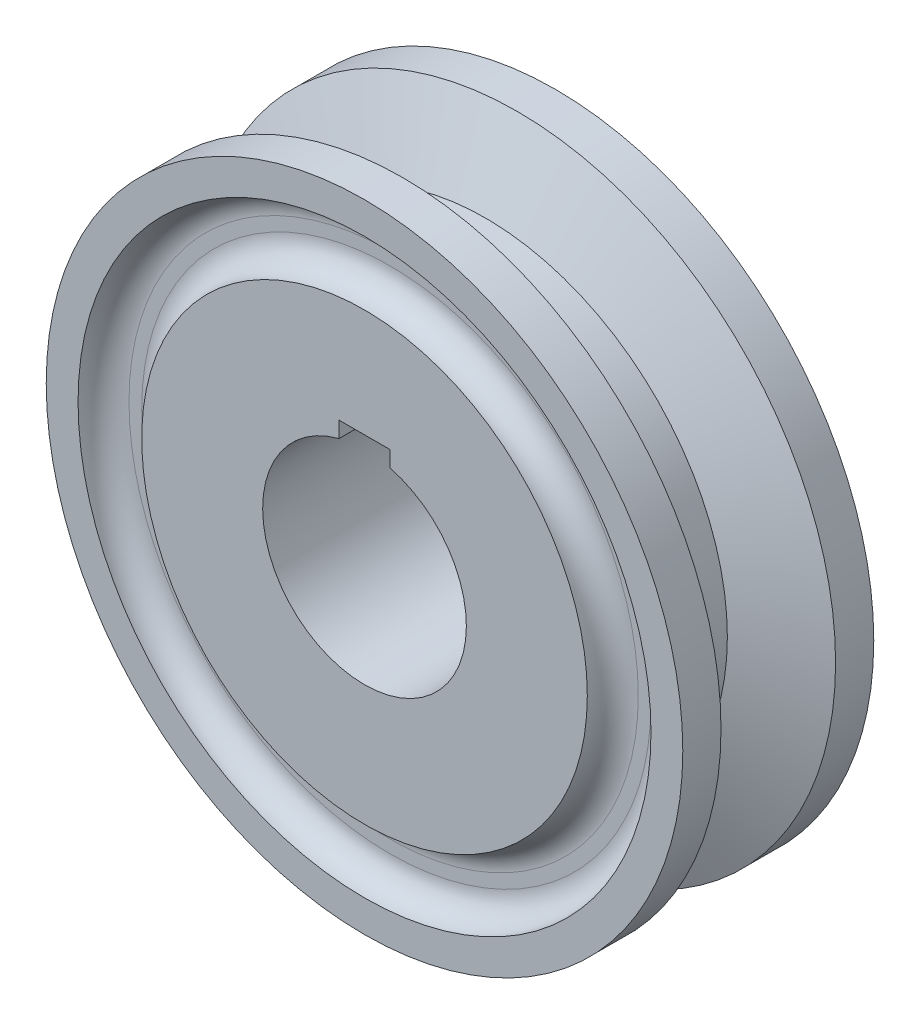
ISO-10303-21;
HEADER;
FILE_DESCRIPTION(('STEP AP214'),'2;1');
FILE_NAME('part.step','',(''),(''),'','','');
FILE_SCHEMA(('AUTOMOTIVE_DESIGN { 1 0 10303 214 1 1 1 1 }'));
ENDSEC;
DATA;
#1=APPLICATION_CONTEXT('core data for automotive mechanical design processes');
#2=APPLICATION_PROTOCOL_DEFINITION('international standard','automotive_design',2000,#1);
#3=PRODUCT_CONTEXT('',#1,'mechanical');
#4=PRODUCT('Part','Part','',(#3));
#5=PRODUCT_RELATED_PRODUCT_CATEGORY('part','',(#4));
#6=PRODUCT_DEFINITION_FORMATION('','',#4);
#7=PRODUCT_DEFINITION_CONTEXT('part definition',#1,'design');
#8=PRODUCT_DEFINITION('design','',#6,#7);
#9=PRODUCT_DEFINITION_SHAPE('','',#8);
#10=(LENGTH_UNIT() NAMED_UNIT(*) SI_UNIT(.MILLI.,.METRE.));
#11=(NAMED_UNIT(*) PLANE_ANGLE_UNIT() SI_UNIT($,.RADIAN.));
#12=(NAMED_UNIT(*) SI_UNIT($,.STERADIAN.) SOLID_ANGLE_UNIT());
#13=UNCERTAINTY_MEASURE_WITH_UNIT(LENGTH_MEASURE(1.E-05),#10,'distance_accuracy_value','');
#14=(GEOMETRIC_REPRESENTATION_CONTEXT(3) GLOBAL_UNCERTAINTY_ASSIGNED_CONTEXT((#13)) GLOBAL_UNIT_ASSIGNED_CONTEXT((#10,
#11,#12)) REPRESENTATION_CONTEXT('',''));
#15=CARTESIAN_POINT('',(0.,0.,0.));
#16=DIRECTION('',(0.,0.,1.));
#17=DIRECTION('',(1.,0.,0.));
#18=AXIS2_PLACEMENT_3D('',#15,#16,#17);
#19=CARTESIAN_POINT('',(0.,25.,-7.5));
#20=DIRECTION('',(0.,0.,1.));
#21=DIRECTION('',(1.,0.,0.));
#22=AXIS2_PLACEMENT_3D('',#19,#20,#21);
#23=PLANE('',#22);
#24=DIRECTION('',(0.,-1.,0.));
#25=VECTOR('',#24,1.);
#26=CARTESIAN_POINT('',(-2.,9.,-7.50000000000001));
#27=LINE('',#26,#25);
#28=CARTESIAN_POINT('',(-2.,9.,-7.50000000000001));
#29=VERTEX_POINT('',#28);
#30=CARTESIAN_POINT('',(-2.,7.74596669241483,-7.50000000000001));
#31=VERTEX_POINT('',#30);
#32=EDGE_CURVE('E96',#29,#31,#27,.T.);
#33=ORIENTED_EDGE('',*,*,#32,.T.);
#34=CARTESIAN_POINT('',(0.,0.,-7.50000000000001));
#35=DIRECTION('',(0.,0.,1.));
#36=DIRECTION('',(1.,0.,0.));
#37=AXIS2_PLACEMENT_3D('',#34,#35,#36);
#38=CIRCLE('',#37,8.);
#39=CARTESIAN_POINT('',(2.,7.74596669241483,-7.50000000000001));
#40=VERTEX_POINT('',#39);
#41=EDGE_CURVE('E89',#31,#40,#38,.T.);
#42=ORIENTED_EDGE('',*,*,#41,.T.);
#43=DIRECTION('',(0.,1.,0.));
#44=VECTOR('',#43,1.);
#45=CARTESIAN_POINT('',(2.,9.,-7.50000000000001));
#46=LINE('',#45,#44);
#47=CARTESIAN_POINT('',(2.,9.,-7.5));
#48=VERTEX_POINT('',#47);
#49=EDGE_CURVE('E99',#40,#48,#46,.T.);
#50=ORIENTED_EDGE('',*,*,#49,.T.);
#51=DIRECTION('',(-1.,0.,0.));
#52=VECTOR('',#51,1.);
#53=CARTESIAN_POINT('',(-2.,9.,-7.50000000000001));
#54=LINE('',#53,#52);
#55=EDGE_CURVE('E69',#48,#29,#54,.T.);
#56=ORIENTED_EDGE('',*,*,#55,.T.);
#57=EDGE_LOOP('',(#33,#42,#50,#56));
#58=FACE_BOUND('',#57,.T.);
#59=CARTESIAN_POINT('',(0.,0.,-7.5));
#60=DIRECTION('',(0.,0.,-1.));
#61=DIRECTION('',(-1.,0.,0.));
#62=AXIS2_PLACEMENT_3D('',#59,#60,#61);
#63=CIRCLE('',#62,17.5);
#64=CARTESIAN_POINT('',(-17.5,0.,-7.5));
#65=VERTEX_POINT('',#64);
#66=EDGE_CURVE('E179',#65,#65,#63,.T.);
#67=ORIENTED_EDGE('',*,*,#66,.T.);
#68=EDGE_LOOP('',(#67));
#69=FACE_BOUND('',#68,.T.);
#70=ADVANCED_FACE('F45',(#58,#69),#23,.F.);
#71=CARTESIAN_POINT('',(0.,25.,7.5));
#72=DIRECTION('',(0.,0.,-1.));
#73=DIRECTION('',(-1.,0.,0.));
#74=AXIS2_PLACEMENT_3D('',#71,#72,#73);
#75=PLANE('',#74);
#76=DIRECTION('',(0.,1.,0.));
#77=VECTOR('',#76,1.);
#78=CARTESIAN_POINT('',(2.,9.,7.5));
#79=LINE('',#78,#77);
#80=CARTESIAN_POINT('',(2.,7.74596669241483,7.5));
#81=VERTEX_POINT('',#80);
#82=CARTESIAN_POINT('',(2.,9.,7.5));
#83=VERTEX_POINT('',#82);
#84=EDGE_CURVE('E123',#81,#83,#79,.T.);
#85=ORIENTED_EDGE('',*,*,#84,.F.);
#86=CARTESIAN_POINT('',(0.,0.,7.5));
#87=DIRECTION('',(0.,0.,1.));
#88=DIRECTION('',(1.,0.,0.));
#89=AXIS2_PLACEMENT_3D('',#86,#87,#88);
#90=CIRCLE('',#89,8.);
#91=CARTESIAN_POINT('',(-2.,7.74596669241483,7.5));
#92=VERTEX_POINT('',#91);
#93=EDGE_CURVE('E61',#92,#81,#90,.T.);
#94=ORIENTED_EDGE('',*,*,#93,.F.);
#95=DIRECTION('',(0.,-1.,0.));
#96=VECTOR('',#95,1.);
#97=CARTESIAN_POINT('',(-2.,9.,7.5));
#98=LINE('',#97,#96);
#99=CARTESIAN_POINT('',(-2.,9.,7.5));
#100=VERTEX_POINT('',#99);
#101=EDGE_CURVE('E107',#100,#92,#98,.T.);
#102=ORIENTED_EDGE('',*,*,#101,.F.);
#103=DIRECTION('',(-1.,0.,0.));
#104=VECTOR('',#103,1.);
#105=CARTESIAN_POINT('',(-2.,9.,7.5));
#106=LINE('',#105,#104);
#107=EDGE_CURVE('E111',#83,#100,#106,.T.);
#108=ORIENTED_EDGE('',*,*,#107,.F.);
#109=EDGE_LOOP('',(#85,#94,#102,#108));
#110=FACE_BOUND('',#109,.T.);
#111=CARTESIAN_POINT('',(0.,0.,7.5));
#112=DIRECTION('',(0.,0.,1.));
#113=DIRECTION('',(1.,0.,0.));
#114=AXIS2_PLACEMENT_3D('',#111,#112,#113);
#115=CIRCLE('',#114,17.5);
#116=CARTESIAN_POINT('',(17.5,0.,7.5));
#117=VERTEX_POINT('',#116);
#118=EDGE_CURVE('E185',#117,#117,#115,.T.);
#119=ORIENTED_EDGE('',*,*,#118,.T.);
#120=EDGE_LOOP('',(#119));
#121=FACE_BOUND('',#120,.T.);
#122=ADVANCED_FACE('F202',(#110,#121),#75,.F.);
#123=CARTESIAN_POINT('',(0.,0.,7.5));
#124=DIRECTION('',(0.,0.,1.));
#125=DIRECTION('',(1.,0.,0.));
#126=AXIS2_PLACEMENT_3D('',#123,#124,#125);
#127=CIRCLE('',#126,22.5);
#128=CARTESIAN_POINT('',(22.5,0.,7.5));
#129=VERTEX_POINT('',#128);
#130=EDGE_CURVE('E114',#129,#129,#127,.T.);
#131=ORIENTED_EDGE('',*,*,#130,.F.);
#132=EDGE_LOOP('',(#131));
#133=FACE_BOUND('',#132,.T.);
#134=CARTESIAN_POINT('',(0.,0.,7.50000000000001));
#135=DIRECTION('',(0.,0.,1.));
#136=DIRECTION('',(1.,0.,0.));
#137=AXIS2_PLACEMENT_3D('',#134,#135,#136);
#138=CIRCLE('',#137,25.);
#139=CARTESIAN_POINT('',(25.,0.,7.50000000000001));
#140=VERTEX_POINT('',#139);
#141=EDGE_CURVE('E132',#140,#140,#138,.T.);
#142=ORIENTED_EDGE('',*,*,#141,.T.);
#143=EDGE_LOOP('',(#142));
#144=FACE_BOUND('',#143,.T.);
#145=ADVANCED_FACE('F198',(#133,#144),#75,.F.);
#146=CARTESIAN_POINT('',(0.,0.,-7.5));
#147=DIRECTION('',(0.,0.,-1.));
#148=DIRECTION('',(-1.,0.,0.));
#149=AXIS2_PLACEMENT_3D('',#146,#147,#148);
#150=CIRCLE('',#149,22.5);
#151=CARTESIAN_POINT('',(-22.5,0.,-7.5));
#152=VERTEX_POINT('',#151);
#153=EDGE_CURVE('E181',#152,#152,#150,.T.);
#154=ORIENTED_EDGE('',*,*,#153,.F.);
#155=EDGE_LOOP('',(#154));
#156=FACE_BOUND('',#155,.T.);
#157=CARTESIAN_POINT('',(0.,0.,-7.50000000000001));
#158=DIRECTION('',(0.,0.,1.));
#159=DIRECTION('',(1.,0.,0.));
#160=AXIS2_PLACEMENT_3D('',#157,#158,#159);
#161=CIRCLE('',#160,25.);
#162=CARTESIAN_POINT('',(25.,0.,-7.50000000000001));
#163=VERTEX_POINT('',#162);
#164=EDGE_CURVE('E157',#163,#163,#161,.T.);
#165=ORIENTED_EDGE('',*,*,#164,.F.);
#166=EDGE_LOOP('',(#165));
#167=FACE_BOUND('',#166,.T.);
#168=ADVANCED_FACE('F201',(#156,#167),#23,.F.);
#169=CARTESIAN_POINT('',(0.,0.,350.137387164883));
#170=DIRECTION('',(0.,0.,1.));
#171=DIRECTION('',(1.,0.,0.));
#172=AXIS2_PLACEMENT_3D('',#169,#170,#171);
#173=CYLINDRICAL_SURFACE('',#172,25.);
#174=CARTESIAN_POINT('',(0.,0.,-4.5));
#175=DIRECTION('',(0.,0.,1.));
#176=DIRECTION('',(1.,0.,0.));
#177=AXIS2_PLACEMENT_3D('',#174,#175,#176);
#178=CIRCLE('',#177,25.);
#179=CARTESIAN_POINT('',(25.,0.,-4.5));
#180=VERTEX_POINT('',#179);
#181=EDGE_CURVE('E153',#180,#180,#178,.T.);
#182=ORIENTED_EDGE('',*,*,#181,.F.);
#183=EDGE_LOOP('',(#182));
#184=FACE_BOUND('',#183,.T.);
#185=ORIENTED_EDGE('',*,*,#164,.T.);
#186=EDGE_LOOP('',(#185));
#187=FACE_BOUND('',#186,.T.);
#188=ADVANCED_FACE('F227',(#184,#187),#173,.T.);
#189=CARTESIAN_POINT('',(0.,0.,-4.5));
#190=DIRECTION('',(0.,0.,-1.));
#191=DIRECTION('',(-1.,0.,0.));
#192=AXIS2_PLACEMENT_3D('',#189,#190,#191);
#193=CONICAL_SURFACE('',#192,25.,1.17600520709513);
#194=CARTESIAN_POINT('',(0.,0.,-2.));
#195=DIRECTION('',(0.,0.,1.));
#196=DIRECTION('',(1.,0.,0.));
#197=AXIS2_PLACEMENT_3D('',#194,#195,#196);
#198=CIRCLE('',#197,19.);
#199=CARTESIAN_POINT('',(19.,0.,-2.));
#200=VERTEX_POINT('',#199);
#201=EDGE_CURVE('E149',#200,#200,#198,.T.);
#202=ORIENTED_EDGE('',*,*,#201,.F.);
#203=EDGE_LOOP('',(#202));
#204=FACE_BOUND('',#203,.T.);
#205=ORIENTED_EDGE('',*,*,#181,.T.);
#206=EDGE_LOOP('',(#205));
#207=FACE_BOUND('',#206,.T.);
#208=ADVANCED_FACE('F221',(#204,#207),#193,.T.);
#209=CARTESIAN_POINT('',(0.,0.,350.137387164883));
#210=DIRECTION('',(0.,0.,1.));
#211=DIRECTION('',(1.,0.,0.));
#212=AXIS2_PLACEMENT_3D('',#209,#210,#211);
#213=CYLINDRICAL_SURFACE('',#212,19.);
#214=CARTESIAN_POINT('',(0.,0.,2.));
#215=DIRECTION('',(0.,0.,1.));
#216=DIRECTION('',(1.,0.,0.));
#217=AXIS2_PLACEMENT_3D('',#214,#215,#216);
#218=CIRCLE('',#217,19.);
#219=CARTESIAN_POINT('',(19.,0.,2.));
#220=VERTEX_POINT('',#219);
#221=EDGE_CURVE('E145',#220,#220,#218,.T.);
#222=ORIENTED_EDGE('',*,*,#221,.F.);
#223=EDGE_LOOP('',(#222));
#224=FACE_BOUND('',#223,.T.);
#225=ORIENTED_EDGE('',*,*,#201,.T.);
#226=EDGE_LOOP('',(#225));
#227=FACE_BOUND('',#226,.T.);
#228=ADVANCED_FACE('F215',(#224,#227),#213,.T.);
#229=CARTESIAN_POINT('',(0.,0.,2.));
#230=DIRECTION('',(0.,0.,1.));
#231=DIRECTION('',(1.,0.,0.));
#232=AXIS2_PLACEMENT_3D('',#229,#230,#231);
#233=CONICAL_SURFACE('',#232,19.,1.17600520709513);
#234=CARTESIAN_POINT('',(0.,0.,4.5));
#235=DIRECTION('',(0.,0.,1.));
#236=DIRECTION('',(1.,0.,0.));
#237=AXIS2_PLACEMENT_3D('',#234,#235,#236);
#238=CIRCLE('',#237,25.);
#239=CARTESIAN_POINT('',(25.,0.,4.5));
#240=VERTEX_POINT('',#239);
#241=EDGE_CURVE('E141',#240,#240,#238,.T.);
#242=ORIENTED_EDGE('',*,*,#241,.F.);
#243=EDGE_LOOP('',(#242));
#244=FACE_BOUND('',#243,.T.);
#245=ORIENTED_EDGE('',*,*,#221,.T.);
#246=EDGE_LOOP('',(#245));
#247=FACE_BOUND('',#246,.T.);
#248=ADVANCED_FACE('F209',(#244,#247),#233,.T.);
#249=CARTESIAN_POINT('',(0.,0.,350.137387164883));
#250=DIRECTION('',(0.,0.,1.));
#251=DIRECTION('',(1.,0.,0.));
#252=AXIS2_PLACEMENT_3D('',#249,#250,#251);
#253=CYLINDRICAL_SURFACE('',#252,25.);
#254=ORIENTED_EDGE('',*,*,#141,.F.);
#255=EDGE_LOOP('',(#254));
#256=FACE_BOUND('',#255,.T.);
#257=ORIENTED_EDGE('',*,*,#241,.T.);
#258=EDGE_LOOP('',(#257));
#259=FACE_BOUND('',#258,.T.);
#260=ADVANCED_FACE('F206',(#256,#259),#253,.T.);
#261=CARTESIAN_POINT('',(0.,0.,-7.50000000000001));
#262=DIRECTION('',(0.,0.,1.));
#263=DIRECTION('',(1.,0.,0.));
#264=AXIS2_PLACEMENT_3D('',#261,#262,#263);
#265=CYLINDRICAL_SURFACE('',#264,8.);
#266=ORIENTED_EDGE('',*,*,#93,.T.);
#267=DIRECTION('',(0.,0.,1.));
#268=VECTOR('',#267,1.);
#269=CARTESIAN_POINT('',(2.,7.74596669241483,-7.50000000000001));
#270=LINE('',#269,#268);
#271=EDGE_CURVE('E85',#40,#81,#270,.T.);
#272=ORIENTED_EDGE('',*,*,#271,.F.);
#273=ORIENTED_EDGE('',*,*,#41,.F.);
#274=DIRECTION('',(0.,0.,1.));
#275=VECTOR('',#274,1.);
#276=CARTESIAN_POINT('',(-2.,7.74596669241483,-7.50000000000001));
#277=LINE('',#276,#275);
#278=EDGE_CURVE('E129',#31,#92,#277,.T.);
#279=ORIENTED_EDGE('',*,*,#278,.T.);
#280=EDGE_LOOP('',(#266,#272,#273,#279));
#281=FACE_BOUND('',#280,.T.);
#282=ADVANCED_FACE('F87',(#281),#265,.F.);
#283=CARTESIAN_POINT('',(-2.,9.,-7.50000000000001));
#284=DIRECTION('',(-1.,0.,0.));
#285=DIRECTION('',(0.,-1.,0.));
#286=AXIS2_PLACEMENT_3D('',#283,#284,#285);
#287=PLANE('',#286);
#288=ORIENTED_EDGE('',*,*,#101,.T.);
#289=ORIENTED_EDGE('',*,*,#278,.F.);
#290=ORIENTED_EDGE('',*,*,#32,.F.);
#291=DIRECTION('',(0.,0.,1.));
#292=VECTOR('',#291,1.);
#293=CARTESIAN_POINT('',(-2.,9.,-7.50000000000001));
#294=LINE('',#293,#292);
#295=EDGE_CURVE('E133',#29,#100,#294,.T.);
#296=ORIENTED_EDGE('',*,*,#295,.T.);
#297=EDGE_LOOP('',(#288,#289,#290,#296));
#298=FACE_BOUND('',#297,.T.);
#299=ADVANCED_FACE('F271',(#298),#287,.F.);
#300=CARTESIAN_POINT('',(-2.,9.,-7.50000000000001));
#301=DIRECTION('',(0.,1.,0.));
#302=DIRECTION('',(0.,0.,1.));
#303=AXIS2_PLACEMENT_3D('',#300,#301,#302);
#304=PLANE('',#303);
#305=ORIENTED_EDGE('',*,*,#107,.T.);
#306=ORIENTED_EDGE('',*,*,#295,.F.);
#307=ORIENTED_EDGE('',*,*,#55,.F.);
#308=DIRECTION('',(0.,0.,1.));
#309=VECTOR('',#308,1.);
#310=CARTESIAN_POINT('',(2.,9.,-7.50000000000001));
#311=LINE('',#310,#309);
#312=EDGE_CURVE('E95',#48,#83,#311,.T.);
#313=ORIENTED_EDGE('',*,*,#312,.T.);
#314=EDGE_LOOP('',(#305,#306,#307,#313));
#315=FACE_BOUND('',#314,.T.);
#316=ADVANCED_FACE('F274',(#315),#304,.F.);
#317=CARTESIAN_POINT('',(2.,9.,-7.50000000000001));
#318=DIRECTION('',(1.,0.,0.));
#319=DIRECTION('',(0.,0.,-1.));
#320=AXIS2_PLACEMENT_3D('',#317,#318,#319);
#321=PLANE('',#320);
#322=ORIENTED_EDGE('',*,*,#84,.T.);
#323=ORIENTED_EDGE('',*,*,#312,.F.);
#324=ORIENTED_EDGE('',*,*,#49,.F.);
#325=ORIENTED_EDGE('',*,*,#271,.T.);
#326=EDGE_LOOP('',(#322,#323,#324,#325));
#327=FACE_BOUND('',#326,.T.);
#328=ADVANCED_FACE('F100',(#327),#321,.F.);
#329=CARTESIAN_POINT('',(0.,0.,5.5));
#330=DIRECTION('',(0.,0.,1.));
#331=DIRECTION('',(1.,0.,0.));
#332=AXIS2_PLACEMENT_3D('',#329,#330,#331);
#333=PLANE('',#332);
#334=CARTESIAN_POINT('',(0.,0.,5.5));
#335=DIRECTION('',(0.,0.,1.));
#336=DIRECTION('',(1.,0.,0.));
#337=AXIS2_PLACEMENT_3D('',#334,#335,#336);
#338=CIRCLE('',#337,20.5);
#339=CARTESIAN_POINT('',(20.5,0.,5.5));
#340=VERTEX_POINT('',#339);
#341=EDGE_CURVE('E165',#340,#340,#338,.T.);
#342=ORIENTED_EDGE('',*,*,#341,.T.);
#343=EDGE_LOOP('',(#342));
#344=FACE_BOUND('',#343,.T.);
#345=CARTESIAN_POINT('',(0.,0.,5.5));
#346=DIRECTION('',(0.,0.,1.));
#347=DIRECTION('',(1.,0.,0.));
#348=AXIS2_PLACEMENT_3D('',#345,#346,#347);
#349=CIRCLE('',#348,19.5);
#350=CARTESIAN_POINT('',(19.5,0.,5.5));
#351=VERTEX_POINT('',#350);
#352=EDGE_CURVE('E161',#351,#351,#349,.F.);
#353=ORIENTED_EDGE('',*,*,#352,.T.);
#354=EDGE_LOOP('',(#353));
#355=FACE_BOUND('',#354,.T.);
#356=ADVANCED_FACE('F263',(#344,#355),#333,.T.);
#357=CARTESIAN_POINT('',(0.,0.,-5.5));
#358=DIRECTION('',(0.,0.,-1.));
#359=DIRECTION('',(-1.,0.,0.));
#360=AXIS2_PLACEMENT_3D('',#357,#358,#359);
#361=PLANE('',#360);
#362=CARTESIAN_POINT('',(0.,0.,-5.5));
#363=DIRECTION('',(0.,0.,-1.));
#364=DIRECTION('',(-1.,0.,0.));
#365=AXIS2_PLACEMENT_3D('',#362,#363,#364);
#366=CIRCLE('',#365,20.5);
#367=CARTESIAN_POINT('',(-20.5,0.,-5.5));
#368=VERTEX_POINT('',#367);
#369=EDGE_CURVE('E11',#368,#368,#366,.T.);
#370=ORIENTED_EDGE('',*,*,#369,.T.);
#371=EDGE_LOOP('',(#370));
#372=FACE_BOUND('',#371,.T.);
#373=CARTESIAN_POINT('',(0.,0.,-5.5));
#374=DIRECTION('',(0.,0.,-1.));
#375=DIRECTION('',(-1.,0.,0.));
#376=AXIS2_PLACEMENT_3D('',#373,#374,#375);
#377=CIRCLE('',#376,19.5);
#378=CARTESIAN_POINT('',(-19.5,0.,-5.5));
#379=VERTEX_POINT('',#378);
#380=EDGE_CURVE('E54',#379,#379,#377,.F.);
#381=ORIENTED_EDGE('',*,*,#380,.T.);
#382=EDGE_LOOP('',(#381));
#383=FACE_BOUND('',#382,.T.);
#384=ADVANCED_FACE('F172',(#372,#383),#361,.T.);
#385=CARTESIAN_POINT('',(0.,0.,7.5));
#386=DIRECTION('',(0.,0.,1.));
#387=DIRECTION('',(1.,0.,0.));
#388=AXIS2_PLACEMENT_3D('',#385,#386,#387);
#389=TOROIDAL_SURFACE('',#388,20.5,2.);
#390=ORIENTED_EDGE('',*,*,#130,.T.);
#391=EDGE_LOOP('',(#390));
#392=FACE_BOUND('',#391,.T.);
#393=ORIENTED_EDGE('',*,*,#341,.F.);
#394=EDGE_LOOP('',(#393));
#395=FACE_BOUND('',#394,.T.);
#396=ADVANCED_FACE('F195',(#392,#395),#389,.F.);
#397=CARTESIAN_POINT('',(0.,0.,7.5));
#398=DIRECTION('',(0.,0.,1.));
#399=DIRECTION('',(1.,0.,0.));
#400=AXIS2_PLACEMENT_3D('',#397,#398,#399);
#401=TOROIDAL_SURFACE('',#400,19.5,2.);
#402=ORIENTED_EDGE('',*,*,#352,.F.);
#403=EDGE_LOOP('',(#402));
#404=FACE_BOUND('',#403,.T.);
#405=ORIENTED_EDGE('',*,*,#118,.F.);
#406=EDGE_LOOP('',(#405));
#407=FACE_BOUND('',#406,.T.);
#408=ADVANCED_FACE('F252',(#404,#407),#401,.F.);
#409=CARTESIAN_POINT('',(0.,0.,-7.5));
#410=DIRECTION('',(0.,0.,-1.));
#411=DIRECTION('',(-1.,0.,0.));
#412=AXIS2_PLACEMENT_3D('',#409,#410,#411);
#413=TOROIDAL_SURFACE('',#412,20.5,2.);
#414=ORIENTED_EDGE('',*,*,#153,.T.);
#415=EDGE_LOOP('',(#414));
#416=FACE_BOUND('',#415,.T.);
#417=ORIENTED_EDGE('',*,*,#369,.F.);
#418=EDGE_LOOP('',(#417));
#419=FACE_BOUND('',#418,.T.);
#420=ADVANCED_FACE('F176',(#416,#419),#413,.F.);
#421=CARTESIAN_POINT('',(0.,0.,-7.5));
#422=DIRECTION('',(0.,0.,-1.));
#423=DIRECTION('',(-1.,0.,0.));
#424=AXIS2_PLACEMENT_3D('',#421,#422,#423);
#425=TOROIDAL_SURFACE('',#424,19.5,2.);
#426=ORIENTED_EDGE('',*,*,#380,.F.);
#427=EDGE_LOOP('',(#426));
#428=FACE_BOUND('',#427,.T.);
#429=ORIENTED_EDGE('',*,*,#66,.F.);
#430=EDGE_LOOP('',(#429));
#431=FACE_BOUND('',#430,.T.);
#432=ADVANCED_FACE('F47',(#428,#431),#425,.F.);
#433=CLOSED_SHELL('',(#70,#122,#145,#168,#188,#208,#228,#248,#260,#282,#299,#316,#328,#356,#384,
#396,#408,#420,#432));
#434=MANIFOLD_SOLID_BREP('B2',#433);
#435=ADVANCED_BREP_SHAPE_REPRESENTATION('',(#18,#434),#14);
#436=SHAPE_DEFINITION_REPRESENTATION(#9,#435);
ENDSEC;
END-ISO-10303-21;
